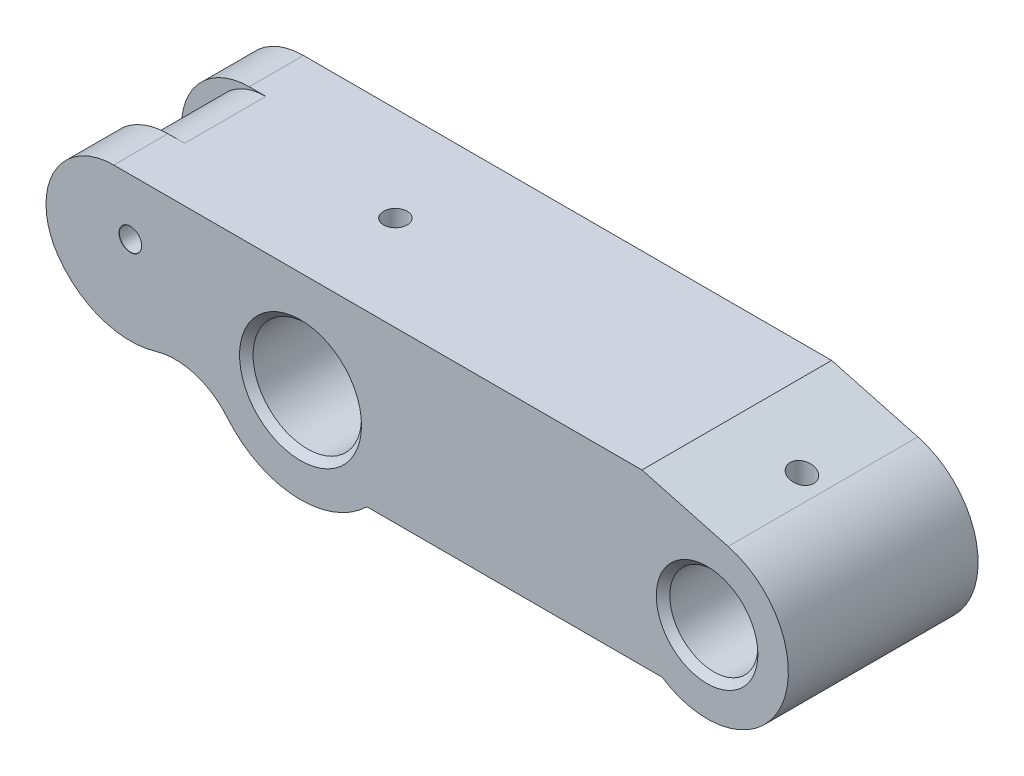
ISO-10303-21;
HEADER;
FILE_DESCRIPTION(('STEP AP214'),'2;1');
FILE_NAME('part.step','',(''),(''),'','','');
FILE_SCHEMA(('AUTOMOTIVE_DESIGN { 1 0 10303 214 1 1 1 1 }'));
ENDSEC;
DATA;
#1=APPLICATION_CONTEXT('core data for automotive mechanical design processes');
#2=APPLICATION_PROTOCOL_DEFINITION('international standard','automotive_design',2000,#1);
#3=PRODUCT_CONTEXT('',#1,'mechanical');
#4=PRODUCT('Part','Part','',(#3));
#5=PRODUCT_RELATED_PRODUCT_CATEGORY('part','',(#4));
#6=PRODUCT_DEFINITION_FORMATION('','',#4);
#7=PRODUCT_DEFINITION_CONTEXT('part definition',#1,'design');
#8=PRODUCT_DEFINITION('design','',#6,#7);
#9=PRODUCT_DEFINITION_SHAPE('','',#8);
#10=(LENGTH_UNIT() NAMED_UNIT(*) SI_UNIT(.MILLI.,.METRE.));
#11=(NAMED_UNIT(*) PLANE_ANGLE_UNIT() SI_UNIT($,.RADIAN.));
#12=(NAMED_UNIT(*) SI_UNIT($,.STERADIAN.) SOLID_ANGLE_UNIT());
#13=UNCERTAINTY_MEASURE_WITH_UNIT(LENGTH_MEASURE(1.E-05),#10,'distance_accuracy_value','');
#14=(GEOMETRIC_REPRESENTATION_CONTEXT(3) GLOBAL_UNCERTAINTY_ASSIGNED_CONTEXT((#13)) GLOBAL_UNIT_ASSIGNED_CONTEXT((#10,
#11,#12)) REPRESENTATION_CONTEXT('',''));
#15=CARTESIAN_POINT('',(0.,0.,0.));
#16=DIRECTION('',(0.,0.,1.));
#17=DIRECTION('',(1.,0.,0.));
#18=AXIS2_PLACEMENT_3D('',#15,#16,#17);
#19=CARTESIAN_POINT('',(60.,0.,-14.));
#20=DIRECTION('',(0.,0.,1.));
#21=DIRECTION('',(1.,0.,0.));
#22=AXIS2_PLACEMENT_3D('',#19,#20,#21);
#23=CYLINDRICAL_SURFACE('',#22,6.5);
#24=CARTESIAN_POINT('',(60.,0.,13.));
#25=DIRECTION('',(0.,0.,1.));
#26=DIRECTION('',(1.,0.,0.));
#27=AXIS2_PLACEMENT_3D('',#24,#25,#26);
#28=CIRCLE('',#27,6.5);
#29=CARTESIAN_POINT('',(66.5,0.,13.));
#30=VERTEX_POINT('',#29);
#31=EDGE_CURVE('E233',#30,#30,#28,.T.);
#32=ORIENTED_EDGE('',*,*,#31,.T.);
#33=EDGE_LOOP('',(#32));
#34=FACE_BOUND('',#33,.T.);
#35=CARTESIAN_POINT('',(60.,0.,-13.));
#36=DIRECTION('',(0.,0.,1.));
#37=DIRECTION('',(1.,0.,0.));
#38=AXIS2_PLACEMENT_3D('',#35,#36,#37);
#39=CIRCLE('',#38,6.5);
#40=CARTESIAN_POINT('',(66.5,0.,-13.));
#41=VERTEX_POINT('',#40);
#42=EDGE_CURVE('E195',#41,#41,#39,.F.);
#43=ORIENTED_EDGE('',*,*,#42,.T.);
#44=EDGE_LOOP('',(#43));
#45=FACE_BOUND('',#44,.T.);
#46=CARTESIAN_POINT('',(60.,6.5,-1.75));
#47=CARTESIAN_POINT('',(60.0964383845188,6.49999858077069,-1.7499977828074));
#48=CARTESIAN_POINT('',(60.1929003880739,6.49783268460272,-1.74200155390307));
#49=CARTESIAN_POINT('',(60.3830433658038,6.48940292607352,-1.71028591961752));
#50=CARTESIAN_POINT('',(60.4767230178816,6.48313714712618,-1.68655916056338));
#51=CARTESIAN_POINT('',(60.6585293424079,6.46719883607986,-1.62421145858157));
#52=CARTESIAN_POINT('',(60.7466630780937,6.45753074507855,-1.58560992574726));
#53=CARTESIAN_POINT('',(60.9152057731972,6.43580830743469,-1.49468095689279));
#54=CARTESIAN_POINT('',(60.9956141778656,6.42375378961486,-1.44235253616187));
#55=CARTESIAN_POINT('',(61.1483209729333,6.3982407904353,-1.32415178517782));
#56=CARTESIAN_POINT('',(61.220411119045,6.38475794940813,-1.25801567224596));
#57=CARTESIAN_POINT('',(61.3526224911526,6.3580634824803,-1.11464065374084));
#58=CARTESIAN_POINT('',(61.4127421445567,6.34485189241872,-1.03740029166848));
#59=CARTESIAN_POINT('',(61.5203271274729,6.31994601039438,-0.872339868303292));
#60=CARTESIAN_POINT('',(61.5675518274617,6.3082824201253,-0.784357907986763));
#61=CARTESIAN_POINT('',(61.6464560679089,6.28815172848446,-0.601338036406505));
#62=CARTESIAN_POINT('',(61.6781385364103,6.2796840251003,-0.506301458068461));
#63=CARTESIAN_POINT('',(61.7243337064602,6.26715552446657,-0.314178852122309));
#64=CARTESIAN_POINT('',(61.7392244492267,6.2629978742277,-0.217190193947394));
#65=CARTESIAN_POINT('',(61.7525922243856,6.25927094241735,-0.0220091357352755));
#66=CARTESIAN_POINT('',(61.7510723879578,6.25970078554045,0.0761830310982101));
#67=CARTESIAN_POINT('',(61.7319620384951,6.26501364939757,0.268024328514741));
#68=CARTESIAN_POINT('',(61.714830111451,6.26976958910593,0.361723222110499));
#69=CARTESIAN_POINT('',(61.6657168471479,6.28299513741087,0.544865031216859));
#70=CARTESIAN_POINT('',(61.6337343026641,6.2914650479176,0.634307600073772));
#71=CARTESIAN_POINT('',(61.5554566636195,6.31127516962315,0.807587747807669));
#72=CARTESIAN_POINT('',(61.5090016916308,6.3226471731219,0.891349315337331));
#73=CARTESIAN_POINT('',(61.4032093828983,6.34696318619014,1.05004880429497));
#74=CARTESIAN_POINT('',(61.3438694661784,6.35990751035925,1.12498495395174));
#75=CARTESIAN_POINT('',(61.2116518260954,6.38643765734519,1.26652520523311));
#76=CARTESIAN_POINT('',(61.1383893230823,6.40003049347118,1.33276907032923));
#77=CARTESIAN_POINT('',(60.9816287226865,6.42594017101052,1.45210498169239));
#78=CARTESIAN_POINT('',(60.8981302065396,6.43825696018163,1.50519648961656));
#79=CARTESIAN_POINT('',(60.7227029023141,6.46030497893973,1.59688349066958));
#80=CARTESIAN_POINT('',(60.6307378934542,6.47002433273058,1.63541272459217));
#81=CARTESIAN_POINT('',(60.4413141801261,6.48569657964708,1.69635922946787));
#82=CARTESIAN_POINT('',(60.3438567053188,6.49165031220561,1.7187800914534));
#83=CARTESIAN_POINT('',(60.1492879675027,6.49899311627936,1.74630531054513));
#84=CARTESIAN_POINT('',(60.0522507391934,6.50051122307747,1.75189931886128));
#85=CARTESIAN_POINT('',(59.8586242668815,6.49918326317947,1.74696574510972));
#86=CARTESIAN_POINT('',(59.7620349766906,6.49633765694801,1.73643986403369));
#87=CARTESIAN_POINT('',(59.573801172243,6.48668544438585,1.69996656502169));
#88=CARTESIAN_POINT('',(59.4820996099891,6.47994927429831,1.67429320907594));
#89=CARTESIAN_POINT('',(59.3043145365378,6.46328097858548,1.60857282182974));
#90=CARTESIAN_POINT('',(59.2182316412844,6.45334850327194,1.56852421776583));
#91=CARTESIAN_POINT('',(59.052232197971,6.43108814161772,1.47428833376005));
#92=CARTESIAN_POINT('',(58.9724721591767,6.41871658060233,1.41983593416573));
#93=CARTESIAN_POINT('',(58.8230500875743,6.39300765310752,1.29867061113965));
#94=CARTESIAN_POINT('',(58.753390094338,6.37967009237027,1.23195521750797));
#95=CARTESIAN_POINT('',(58.6240751634552,6.35305606912347,1.08587114701199));
#96=CARTESIAN_POINT('',(58.5647659670637,6.33979241811592,1.00619350712984));
#97=CARTESIAN_POINT('',(58.4603513455051,6.31524898835376,0.837735178091463));
#98=CARTESIAN_POINT('',(58.4152453372948,6.3039691281726,0.748954862799982));
#99=CARTESIAN_POINT('',(58.3408564712067,6.28480064726651,0.565246373403216));
#100=CARTESIAN_POINT('',(58.3114827338072,6.27689260413138,0.470357135721138));
#101=CARTESIAN_POINT('',(58.269182331408,6.26536192393188,0.276736303375831));
#102=CARTESIAN_POINT('',(58.2562513639001,6.26173816583469,0.178005720832141));
#103=CARTESIAN_POINT('',(58.2474545264397,6.25928126935112,-0.0169519056141194));
#104=CARTESIAN_POINT('',(58.2510324261671,6.2602919755006,-0.113152255566914));
#105=CARTESIAN_POINT('',(58.273858758265,6.26662379645531,-0.303523541672148));
#106=CARTESIAN_POINT('',(58.2931067724926,6.27194479624422,-0.397694531907395));
#107=CARTESIAN_POINT('',(58.3464016206556,6.28620380749049,-0.58061865799919));
#108=CARTESIAN_POINT('',(58.3803284410029,6.29511244645101,-0.669409210950858));
#109=CARTESIAN_POINT('',(58.4619247453846,6.31554316959918,-0.840105632385476));
#110=CARTESIAN_POINT('',(58.5095964229881,6.32706567087568,-0.922010399255227));
#111=CARTESIAN_POINT('',(58.6190058756084,6.35185689602158,-1.07926000063728));
#112=CARTESIAN_POINT('',(58.681122189747,6.36516758553448,-1.15433487479488));
#113=CARTESIAN_POINT('',(58.816940580298,6.39180345359531,-1.29317612586821));
#114=CARTESIAN_POINT('',(58.8906454818129,6.40512863488741,-1.35693973720047));
#115=CARTESIAN_POINT('',(59.0494993137465,6.43064166563152,-1.47272473629476));
#116=CARTESIAN_POINT('',(59.1348637916753,6.44279815943238,-1.5244579047006));
#117=CARTESIAN_POINT('',(59.3134029161651,6.46425897327365,-1.61275802734169));
#118=CARTESIAN_POINT('',(59.4065726023693,6.4735650875332,-1.64933452733467));
#119=CARTESIAN_POINT('',(59.5828042983082,6.48710112720969,-1.70161906201364));
#120=CARTESIAN_POINT('',(59.6651205488894,6.49190262266324,-1.71971928739135));
#121=CARTESIAN_POINT('',(59.8316186600637,6.498352516354,-1.74391010625434));
#122=CARTESIAN_POINT('',(59.9158003277393,6.50000123911909,-1.75000193581521));
#123=CARTESIAN_POINT('',(60.,6.5,-1.75));
#124=B_SPLINE_CURVE_WITH_KNOTS('',3,(#46,#47,#48,#49,#50,#51,#52,#53,#54,#55,#56,#57,#58,#59,
#60,#61,#62,#63,#64,#65,#66,#67,#68,#69,#70,#71,#72,#73,#74,#75,#76,#77,#78,#79,#80,#81,#82,#83,
#84,#85,#86,#87,#88,#89,#90,#91,#92,#93,#94,#95,#96,#97,#98,#99,#100,#101,#102,#103,#104,#105,
#106,#107,#108,#109,#110,#111,#112,#113,#114,#115,#116,#117,#118,#119,#120,#121,#122,#123),
.UNSPECIFIED.,.T.,.F.,(4,2,2,2,2,2,2,2,2,2,2,2,2,2,2,2,2,2,2,2,2,2,2,2,2,2,2,2,2,2,2,2,2,2,2,2,
2,2,4),(0.,0.289006335573644,0.578147870533283,0.866913375415958,1.15569960082183,
1.45061243661619,1.7455639902778,2.04569252574375,2.34576449744911,2.63893678842027,
2.93205314237057,3.21682770404029,3.50162541943879,3.7896880895128,4.07780849218071,
4.37551645612282,4.67323660362118,4.97229553813187,5.27128778285868,5.56149104488235,
5.85166368639026,6.13674063704052,6.42184878682808,6.71262194530668,7.00345374008025,
7.30265769073015,7.60184935740545,7.89929353562963,8.19665986690054,8.48408165680868,
8.77149577737717,9.05660314326086,9.34175603520537,9.63544979343368,9.92921526058424,
10.229423951748,10.5294432813106,10.7817986486686,11.0341280386515),.UNSPECIFIED.);
#125=CARTESIAN_POINT('',(60.,6.5,-1.75));
#126=VERTEX_POINT('',#125);
#127=EDGE_CURVE('E205',#126,#126,#124,.T.);
#128=ORIENTED_EDGE('',*,*,#127,.F.);
#129=EDGE_LOOP('',(#128));
#130=FACE_BOUND('',#129,.T.);
#131=ADVANCED_FACE('F37',(#34,#45,#130),#23,.F.);
#132=CARTESIAN_POINT('',(0.,0.,-14.));
#133=DIRECTION('',(0.,0.,1.));
#134=DIRECTION('',(1.,0.,0.));
#135=AXIS2_PLACEMENT_3D('',#132,#133,#134);
#136=CYLINDRICAL_SURFACE('',#135,8.);
#137=CARTESIAN_POINT('',(0.,0.,-13.));
#138=DIRECTION('',(0.,0.,1.));
#139=DIRECTION('',(1.,0.,0.));
#140=AXIS2_PLACEMENT_3D('',#137,#138,#139);
#141=CIRCLE('',#140,8.);
#142=CARTESIAN_POINT('',(8.,0.,-13.));
#143=VERTEX_POINT('',#142);
#144=EDGE_CURVE('E11',#143,#143,#141,.F.);
#145=ORIENTED_EDGE('',*,*,#144,.T.);
#146=EDGE_LOOP('',(#145));
#147=FACE_BOUND('',#146,.T.);
#148=CARTESIAN_POINT('',(0.,0.,13.));
#149=DIRECTION('',(0.,0.,1.));
#150=DIRECTION('',(1.,0.,0.));
#151=AXIS2_PLACEMENT_3D('',#148,#149,#150);
#152=CIRCLE('',#151,8.);
#153=CARTESIAN_POINT('',(8.,0.,13.));
#154=VERTEX_POINT('',#153);
#155=EDGE_CURVE('E46',#154,#154,#152,.T.);
#156=ORIENTED_EDGE('',*,*,#155,.T.);
#157=EDGE_LOOP('',(#156));
#158=FACE_BOUND('',#157,.T.);
#159=CARTESIAN_POINT('',(0.,8.,-1.75));
#160=CARTESIAN_POINT('',(0.0970593350151599,7.99999820976199,-1.74999668573652));
#161=CARTESIAN_POINT('',(0.194158718935764,7.99821570498197,-1.74189801333876));
#162=CARTESIAN_POINT('',(0.385599393425195,7.99127711250709,-1.70975094723352));
#163=CARTESIAN_POINT('',(0.479938663088247,7.98611861450843,-1.68569115785522));
#164=CARTESIAN_POINT('',(0.663064722809455,7.973002390759,-1.62241151171509));
#165=CARTESIAN_POINT('',(0.751857201182268,7.96504759005983,-1.58320749224003));
#166=CARTESIAN_POINT('',(0.921601058551572,7.94719730036193,-1.49080250331855));
#167=CARTESIAN_POINT('',(1.00255264012586,7.93730186152161,-1.4376018956207));
#168=CARTESIAN_POINT('',(1.15561917902203,7.91647673705169,-1.31781028937509));
#169=CARTESIAN_POINT('',(1.22759027771492,7.90553422192293,-1.25103768659902));
#170=CARTESIAN_POINT('',(1.3594054745263,7.88393863133685,-1.10638738709634));
#171=CARTESIAN_POINT('',(1.41924849117725,7.87328558176462,-1.02850870108833));
#172=CARTESIAN_POINT('',(1.52574354875191,7.85334859305538,-0.862793234416184));
#173=CARTESIAN_POINT('',(1.57224243577139,7.84408109293136,-0.774855876820513));
#174=CARTESIAN_POINT('',(1.64974688983709,7.82814863989338,-0.592179157988641));
#175=CARTESIAN_POINT('',(1.68075430981412,7.82148337574742,-0.497440611792102));
#176=CARTESIAN_POINT('',(1.72592019766616,7.8116407126826,-0.305411304961213));
#177=CARTESIAN_POINT('',(1.74033336961636,7.80841064772011,-0.208183208714533));
#178=CARTESIAN_POINT('',(1.75269359259673,7.80564592573969,-0.0126394392104041));
#179=CARTESIAN_POINT('',(1.75064266801701,7.80611081439809,0.0856760988530383));
#180=CARTESIAN_POINT('',(1.73033788658275,7.81063579363394,0.278710335103449));
#181=CARTESIAN_POINT('',(1.71237992433051,7.81463022611758,0.373461930057892));
#182=CARTESIAN_POINT('',(1.66123961776057,7.82566041064141,0.558574112916662));
#183=CARTESIAN_POINT('',(1.62805641913031,7.83269633334324,0.648934454105961));
#184=CARTESIAN_POINT('',(1.54713590259168,7.84908142575243,0.823530934289775));
#185=CARTESIAN_POINT('',(1.49928481262593,7.85844856683516,0.907712586421171));
#186=CARTESIAN_POINT('',(1.39046682908872,7.87842963219284,1.06696091821976));
#187=CARTESIAN_POINT('',(1.32949814730235,7.88904372636514,1.14202635296209));
#188=CARTESIAN_POINT('',(1.19460937489082,7.91060446260824,1.28261496039221));
#189=CARTESIAN_POINT('',(1.12043767851035,7.92155333191846,1.34789662473363));
#190=CARTESIAN_POINT('',(0.962075236204359,7.94234089245359,1.46513376259774));
#191=CARTESIAN_POINT('',(0.87788430875842,7.95217956355851,1.51708899462897));
#192=CARTESIAN_POINT('',(0.701578448800819,7.96967012140719,1.60625815763234));
#193=CARTESIAN_POINT('',(0.609447011102093,7.97731730300529,1.64344043607346));
#194=CARTESIAN_POINT('',(0.420039431240134,7.98952827368579,1.70172886696758));
#195=CARTESIAN_POINT('',(0.32276403956642,7.99409251123073,1.72283735766183));
#196=CARTESIAN_POINT('',(0.127901429629175,7.99955949359536,1.74802773381646));
#197=CARTESIAN_POINT('',(0.0303587923624098,8.00053317276936,1.75243952268135));
#198=CARTESIAN_POINT('',(-0.164069740933707,7.99890811067611,1.74500545649902));
#199=CARTESIAN_POINT('',(-0.260955681068858,7.9963096117651,1.73316070438523));
#200=CARTESIAN_POINT('',(-0.450227474165147,7.98787693126455,1.69382333511614));
#201=CARTESIAN_POINT('',(-0.542651027433255,7.98207854907296,1.66650375819105));
#202=CARTESIAN_POINT('',(-0.721603760326953,7.96789511342711,1.59718431391311));
#203=CARTESIAN_POINT('',(-0.808132436960157,7.95950983957769,1.55518319569776));
#204=CARTESIAN_POINT('',(-0.97420328371358,7.94090779663354,1.45700558634168));
#205=CARTESIAN_POINT('',(-1.05362808603427,7.93066659115626,1.40063529646222));
#206=CARTESIAN_POINT('',(-1.20200932191072,7.90953858077059,1.27557468866277));
#207=CARTESIAN_POINT('',(-1.2709643934262,7.898651692119,1.20688277031462));
#208=CARTESIAN_POINT('',(-1.39775310506235,7.87721432670249,1.05761497669148));
#209=CARTESIAN_POINT('',(-1.45535830381534,7.86667375069786,0.976843376890895));
#210=CARTESIAN_POINT('',(-1.55618726114744,7.84735161891496,0.806578421307945));
#211=CARTESIAN_POINT('',(-1.5994116419906,7.83856998703299,0.717085443120003));
#212=CARTESIAN_POINT('',(-1.66996009440668,7.82384388791895,0.532397964671863));
#213=CARTESIAN_POINT('',(-1.69737356394447,7.81788350386444,0.43723894513755));
#214=CARTESIAN_POINT('',(-1.73578387332271,7.80944608384998,0.243517995359719));
#215=CARTESIAN_POINT('',(-1.74678333897331,7.80696849073849,0.144956611986848));
#216=CARTESIAN_POINT('',(-1.75194163710046,7.80581228747132,-0.0504679246802261));
#217=CARTESIAN_POINT('',(-1.74646267912392,7.80705196674948,-0.147321209617316));
#218=CARTESIAN_POINT('',(-1.7196294204196,7.81300583032519,-0.338688623096862));
#219=CARTESIAN_POINT('',(-1.69827530684468,7.81771997366214,-0.433202779201831));
#220=CARTESIAN_POINT('',(-1.64047291068329,7.83005176572579,-0.616921231638351));
#221=CARTESIAN_POINT('',(-1.60407735181834,7.83765926522136,-0.706142842572677));
#222=CARTESIAN_POINT('',(-1.51727048968564,7.85492457749753,-0.877267291554995));
#223=CARTESIAN_POINT('',(-1.46685772585982,7.86458260391317,-0.959169365749573));
#224=CARTESIAN_POINT('',(-1.35224615086081,7.88510483142732,-1.11511534841375));
#225=CARTESIAN_POINT('',(-1.28778921304302,7.89598947159459,-1.18896689450643));
#226=CARTESIAN_POINT('',(-1.14744205512987,7.91760116007137,-1.32492424692627));
#227=CARTESIAN_POINT('',(-1.07154919548322,7.92832817136922,-1.3870273340814));
#228=CARTESIAN_POINT('',(-0.909297791240161,7.948581041013,-1.49849633485223));
#229=CARTESIAN_POINT('',(-0.82281622163743,7.95808950687133,-1.54768651274941));
#230=CARTESIAN_POINT('',(-0.642622783374224,7.97465942662438,-1.63075470037653));
#231=CARTESIAN_POINT('',(-0.548917055005223,7.98172293121789,-1.66464554963414));
#232=CARTESIAN_POINT('',(-0.37926518196647,7.99134698819861,-1.71011403623908));
#233=CARTESIAN_POINT('',(-0.304236707923587,7.99457176616468,-1.72504272890552));
#234=CARTESIAN_POINT('',(-0.152813724405272,7.99889892979335,-1.74498679580468));
#235=CARTESIAN_POINT('',(-0.0764192756345343,8.00000140953667,-1.75000260947197));
#236=CARTESIAN_POINT('',(0.,8.,-1.75));
#237=B_SPLINE_CURVE_WITH_KNOTS('',3,(#159,#160,#161,#162,#163,#164,#165,#166,#167,#168,#169,
#170,#171,#172,#173,#174,#175,#176,#177,#178,#179,#180,#181,#182,#183,#184,#185,#186,#187,#188,
#189,#190,#191,#192,#193,#194,#195,#196,#197,#198,#199,#200,#201,#202,#203,#204,#205,#206,#207,
#208,#209,#210,#211,#212,#213,#214,#215,#216,#217,#218,#219,#220,#221,#222,#223,#224,#225,#226,
#227,#228,#229,#230,#231,#232,#233,#234,#235,#236),.UNSPECIFIED.,.T.,.F.,(4,2,2,2,2,2,2,2,2,2,2,
2,2,2,2,2,2,2,2,2,2,2,2,2,2,2,2,2,2,2,2,2,2,2,2,2,2,2,4),(0.,0.290898279236849,
0.582004473362016,0.872807059744418,1.16360213093151,1.45858009706578,1.7535843549802,
2.05185017097239,2.3500803029129,2.64366919108494,2.93722198074803,3.2254263046949,
3.51364680222945,3.80416202417276,4.0947168748217,4.39155618463579,4.6884008731661,
4.9858781948911,5.28331223455319,5.5748377527744,5.86634349327398,6.15465219015976,
6.44298545684156,6.73543477188155,7.02792210003658,7.32580107786389,7.6236671646654,
7.9198321172811,8.21594968619037,8.50560626091059,8.79525942091184,9.08390577736446,
9.37258222133171,9.66709530846838,9.96167647726522,10.2600801610668,10.5582329503546,
10.7872806901088,11.0163182760262),.UNSPECIFIED.);
#238=CARTESIAN_POINT('',(0.,8.,-1.75));
#239=VERTEX_POINT('',#238);
#240=EDGE_CURVE('E196',#239,#239,#237,.T.);
#241=ORIENTED_EDGE('',*,*,#240,.F.);
#242=EDGE_LOOP('',(#241));
#243=FACE_BOUND('',#242,.T.);
#244=ADVANCED_FACE('F212',(#147,#158,#243),#136,.F.);
#245=CARTESIAN_POINT('',(-27.5655074312404,5.,14.));
#246=DIRECTION('',(0.,0.,-1.));
#247=DIRECTION('',(-1.,0.,0.));
#248=AXIS2_PLACEMENT_3D('',#245,#246,#247);
#249=CYLINDRICAL_SURFACE('',#248,10.);
#250=CARTESIAN_POINT('',(-27.5655074312404,5.,6.));
#251=DIRECTION('',(0.,0.,-1.));
#252=DIRECTION('',(-1.,0.,0.));
#253=AXIS2_PLACEMENT_3D('',#250,#251,#252);
#254=CIRCLE('',#253,10.);
#255=CARTESIAN_POINT('',(-35.7369605903223,-0.764317242217897,6.));
#256=VERTEX_POINT('',#255);
#257=CARTESIAN_POINT('',(-27.5655074312404,15.,6.));
#258=VERTEX_POINT('',#257);
#259=EDGE_CURVE('E138',#256,#258,#254,.T.);
#260=ORIENTED_EDGE('',*,*,#259,.F.);
#261=DIRECTION('',(0.,0.,-1.));
#262=VECTOR('',#261,1.);
#263=CARTESIAN_POINT('',(-35.7369605903223,-0.764317242217896,14.));
#264=LINE('',#263,#262);
#265=CARTESIAN_POINT('',(-35.7369605903223,-0.764317242217896,14.));
#266=VERTEX_POINT('',#265);
#267=EDGE_CURVE('E134',#266,#256,#264,.T.);
#268=ORIENTED_EDGE('',*,*,#267,.F.);
#269=CARTESIAN_POINT('',(-27.5655074312404,5.,14.));
#270=DIRECTION('',(0.,0.,1.));
#271=DIRECTION('',(1.,0.,0.));
#272=AXIS2_PLACEMENT_3D('',#269,#270,#271);
#273=CIRCLE('',#272,10.);
#274=CARTESIAN_POINT('',(-27.5655074312404,15.,14.));
#275=VERTEX_POINT('',#274);
#276=EDGE_CURVE('E120',#275,#266,#273,.T.);
#277=ORIENTED_EDGE('',*,*,#276,.F.);
#278=DIRECTION('',(0.,0.,-1.));
#279=VECTOR('',#278,1.);
#280=CARTESIAN_POINT('',(-27.5655074312404,15.,14.));
#281=LINE('',#280,#279);
#282=EDGE_CURVE('E177',#275,#258,#281,.T.);
#283=ORIENTED_EDGE('',*,*,#282,.T.);
#284=EDGE_LOOP('',(#260,#268,#277,#283));
#285=FACE_BOUND('',#284,.T.);
#286=ADVANCED_FACE('F135',(#285),#249,.T.);
#287=CARTESIAN_POINT('',(-25.1140714835158,6.72929517266537,14.));
#288=DIRECTION('',(0.,0.,-1.));
#289=DIRECTION('',(-1.,0.,0.));
#290=AXIS2_PLACEMENT_3D('',#287,#288,#289);
#291=CYLINDRICAL_SURFACE('',#290,13.);
#292=CARTESIAN_POINT('',(-25.1140714835158,6.72929517266537,6.));
#293=DIRECTION('',(0.,0.,-1.));
#294=DIRECTION('',(-1.,0.,0.));
#295=AXIS2_PLACEMENT_3D('',#292,#293,#294);
#296=CIRCLE('',#295,13.);
#297=CARTESIAN_POINT('',(-21.3718264681811,-5.72042780598772,6.));
#298=VERTEX_POINT('',#297);
#299=EDGE_CURVE('E269',#298,#256,#296,.T.);
#300=ORIENTED_EDGE('',*,*,#299,.F.);
#301=DIRECTION('',(0.,0.,-1.));
#302=VECTOR('',#301,1.);
#303=CARTESIAN_POINT('',(-21.3718264681811,-5.72042780598772,14.));
#304=LINE('',#303,#302);
#305=CARTESIAN_POINT('',(-21.3718264681811,-5.72042780598772,14.));
#306=VERTEX_POINT('',#305);
#307=EDGE_CURVE('E146',#306,#298,#304,.T.);
#308=ORIENTED_EDGE('',*,*,#307,.F.);
#309=CARTESIAN_POINT('',(-25.1140714835158,6.72929517266537,14.));
#310=DIRECTION('',(0.,0.,1.));
#311=DIRECTION('',(1.,0.,0.));
#312=AXIS2_PLACEMENT_3D('',#309,#310,#311);
#313=CIRCLE('',#312,13.);
#314=EDGE_CURVE('E124',#266,#306,#313,.T.);
#315=ORIENTED_EDGE('',*,*,#314,.F.);
#316=ORIENTED_EDGE('',*,*,#267,.T.);
#317=EDGE_LOOP('',(#300,#308,#315,#316));
#318=FACE_BOUND('',#317,.T.);
#319=ADVANCED_FACE('F144',(#318),#291,.T.);
#320=CARTESIAN_POINT('',(-18.4931764563852,-15.297137789567,14.));
#321=DIRECTION('',(0.,0.,-1.));
#322=DIRECTION('',(-1.,0.,0.));
#323=AXIS2_PLACEMENT_3D('',#320,#321,#322);
#324=CYLINDRICAL_SURFACE('',#323,10.);
#325=CARTESIAN_POINT('',(-18.4931764563852,-15.297137789567,6.));
#326=DIRECTION('',(0.,0.,-1.));
#327=DIRECTION('',(-1.,0.,0.));
#328=AXIS2_PLACEMENT_3D('',#325,#326,#327);
#329=CIRCLE('',#328,10.);
#330=CARTESIAN_POINT('',(-10.7876862662247,-8.92333037724742,6.));
#331=VERTEX_POINT('',#330);
#332=EDGE_CURVE('E190',#331,#298,#329,.F.);
#333=ORIENTED_EDGE('',*,*,#332,.F.);
#334=DIRECTION('',(0.,0.,-1.));
#335=VECTOR('',#334,1.);
#336=CARTESIAN_POINT('',(-10.7876862662247,-8.92333037724742,14.));
#337=LINE('',#336,#335);
#338=CARTESIAN_POINT('',(-10.7876862662247,-8.92333037724742,14.));
#339=VERTEX_POINT('',#338);
#340=EDGE_CURVE('E172',#339,#331,#337,.T.);
#341=ORIENTED_EDGE('',*,*,#340,.F.);
#342=CARTESIAN_POINT('',(-18.4931764563852,-15.297137789567,14.));
#343=DIRECTION('',(0.,0.,-1.));
#344=DIRECTION('',(-1.,0.,0.));
#345=AXIS2_PLACEMENT_3D('',#342,#343,#344);
#346=CIRCLE('',#345,10.);
#347=EDGE_CURVE('E62',#306,#339,#346,.T.);
#348=ORIENTED_EDGE('',*,*,#347,.F.);
#349=ORIENTED_EDGE('',*,*,#307,.T.);
#350=EDGE_LOOP('',(#333,#341,#348,#349));
#351=FACE_BOUND('',#350,.T.);
#352=ADVANCED_FACE('F347',(#351),#324,.F.);
#353=CARTESIAN_POINT('',(0.,0.,14.));
#354=DIRECTION('',(0.,0.,-1.));
#355=DIRECTION('',(-1.,0.,0.));
#356=AXIS2_PLACEMENT_3D('',#353,#354,#355);
#357=CYLINDRICAL_SURFACE('',#356,14.);
#358=CARTESIAN_POINT('',(0.,0.,-14.));
#359=DIRECTION('',(0.,0.,1.));
#360=DIRECTION('',(1.,0.,0.));
#361=AXIS2_PLACEMENT_3D('',#358,#359,#360);
#362=CIRCLE('',#361,14.);
#363=CARTESIAN_POINT('',(-10.7876862662247,-8.92333037724742,-14.));
#364=VERTEX_POINT('',#363);
#365=CARTESIAN_POINT('',(9.79795897113271,-10.,-14.));
#366=VERTEX_POINT('',#365);
#367=EDGE_CURVE('E151',#364,#366,#362,.T.);
#368=ORIENTED_EDGE('',*,*,#367,.T.);
#369=DIRECTION('',(0.,0.,-1.));
#370=VECTOR('',#369,1.);
#371=CARTESIAN_POINT('',(9.79795897113271,-10.,14.));
#372=LINE('',#371,#370);
#373=CARTESIAN_POINT('',(9.79795897113271,-10.,14.));
#374=VERTEX_POINT('',#373);
#375=EDGE_CURVE('E188',#374,#366,#372,.T.);
#376=ORIENTED_EDGE('',*,*,#375,.F.);
#377=CARTESIAN_POINT('',(0.,0.,14.));
#378=DIRECTION('',(0.,0.,1.));
#379=DIRECTION('',(1.,0.,0.));
#380=AXIS2_PLACEMENT_3D('',#377,#378,#379);
#381=CIRCLE('',#380,14.);
#382=EDGE_CURVE('E171',#339,#374,#381,.T.);
#383=ORIENTED_EDGE('',*,*,#382,.F.);
#384=ORIENTED_EDGE('',*,*,#340,.T.);
#385=DIRECTION('',(0.,0.,1.));
#386=VECTOR('',#385,1.);
#387=CARTESIAN_POINT('',(-10.7876862662247,-8.92333037724742,-6.));
#388=LINE('',#387,#386);
#389=CARTESIAN_POINT('',(-10.7876862662247,-8.92333037724742,-6.));
#390=VERTEX_POINT('',#389);
#391=EDGE_CURVE('E267',#390,#331,#388,.T.);
#392=ORIENTED_EDGE('',*,*,#391,.F.);
#393=EDGE_CURVE('E96',#390,#364,#337,.T.);
#394=ORIENTED_EDGE('',*,*,#393,.T.);
#395=EDGE_LOOP('',(#368,#376,#383,#384,#392,#394));
#396=FACE_BOUND('',#395,.T.);
#397=ADVANCED_FACE('F339',(#396),#357,.T.);
#398=CARTESIAN_POINT('',(9.79795897113271,-10.,14.));
#399=DIRECTION('',(0.,1.,0.));
#400=DIRECTION('',(0.,0.,1.));
#401=AXIS2_PLACEMENT_3D('',#398,#399,#400);
#402=PLANE('',#401);
#403=DIRECTION('',(1.,0.,0.));
#404=VECTOR('',#403,1.);
#405=CARTESIAN_POINT('',(9.79795897113271,-10.,-14.));
#406=LINE('',#405,#404);
#407=CARTESIAN_POINT('',(53.3667504192892,-10.,-14.));
#408=VERTEX_POINT('',#407);
#409=EDGE_CURVE('E153',#366,#408,#406,.T.);
#410=ORIENTED_EDGE('',*,*,#409,.T.);
#411=DIRECTION('',(0.,0.,-1.));
#412=VECTOR('',#411,1.);
#413=CARTESIAN_POINT('',(53.3667504192892,-10.,14.));
#414=LINE('',#413,#412);
#415=CARTESIAN_POINT('',(53.3667504192892,-10.,14.));
#416=VERTEX_POINT('',#415);
#417=EDGE_CURVE('E185',#416,#408,#414,.T.);
#418=ORIENTED_EDGE('',*,*,#417,.F.);
#419=DIRECTION('',(1.,0.,0.));
#420=VECTOR('',#419,1.);
#421=CARTESIAN_POINT('',(9.79795897113271,-10.,14.));
#422=LINE('',#421,#420);
#423=EDGE_CURVE('E105',#374,#416,#422,.T.);
#424=ORIENTED_EDGE('',*,*,#423,.F.);
#425=ORIENTED_EDGE('',*,*,#375,.T.);
#426=EDGE_LOOP('',(#410,#418,#424,#425));
#427=FACE_BOUND('',#426,.T.);
#428=ADVANCED_FACE('F386',(#427),#402,.F.);
#429=CARTESIAN_POINT('',(60.,0.,14.));
#430=DIRECTION('',(0.,0.,-1.));
#431=DIRECTION('',(-1.,0.,0.));
#432=AXIS2_PLACEMENT_3D('',#429,#430,#431);
#433=CYLINDRICAL_SURFACE('',#432,12.);
#434=CARTESIAN_POINT('',(60.,0.,-14.));
#435=DIRECTION('',(0.,0.,1.));
#436=DIRECTION('',(1.,0.,0.));
#437=AXIS2_PLACEMENT_3D('',#434,#435,#436);
#438=CIRCLE('',#437,12.);
#439=CARTESIAN_POINT('',(63.1058285412303,11.5911099154688,-14.));
#440=VERTEX_POINT('',#439);
#441=EDGE_CURVE('E156',#408,#440,#438,.T.);
#442=ORIENTED_EDGE('',*,*,#441,.T.);
#443=DIRECTION('',(0.,0.,-1.));
#444=VECTOR('',#443,1.);
#445=CARTESIAN_POINT('',(63.1058285412303,11.5911099154688,14.));
#446=LINE('',#445,#444);
#447=CARTESIAN_POINT('',(63.1058285412303,11.5911099154688,14.));
#448=VERTEX_POINT('',#447);
#449=EDGE_CURVE('E182',#448,#440,#446,.T.);
#450=ORIENTED_EDGE('',*,*,#449,.F.);
#451=CARTESIAN_POINT('',(60.,0.,14.));
#452=DIRECTION('',(0.,0.,1.));
#453=DIRECTION('',(1.,0.,0.));
#454=AXIS2_PLACEMENT_3D('',#451,#452,#453);
#455=CIRCLE('',#454,12.);
#456=EDGE_CURVE('E291',#416,#448,#455,.T.);
#457=ORIENTED_EDGE('',*,*,#456,.F.);
#458=ORIENTED_EDGE('',*,*,#417,.T.);
#459=EDGE_LOOP('',(#442,#450,#457,#458));
#460=FACE_BOUND('',#459,.T.);
#461=ADVANCED_FACE('F382',(#460),#433,.T.);
#462=CARTESIAN_POINT('',(50.3836775483421,15.,14.));
#463=DIRECTION('',(-0.258819045102521,-0.965925826289068,0.));
#464=DIRECTION('',(0.965925826289068,-0.258819045102521,0.));
#465=AXIS2_PLACEMENT_3D('',#462,#463,#464);
#466=PLANE('',#465);
#467=CARTESIAN_POINT('',(60.,12.423314164921,0.));
#468=DIRECTION('',(-0.258819045102521,-0.965925826289068,0.));
#469=DIRECTION('',(0.965925826289068,-0.258819045102521,0.));
#470=AXIS2_PLACEMENT_3D('',#467,#468,#469);
#471=ELLIPSE('',#470,1.81173331571765,1.75);
#472=CARTESIAN_POINT('',(61.75,11.9544030781665,0.));
#473=VERTEX_POINT('',#472);
#474=EDGE_CURVE('E240',#473,#473,#471,.F.);
#475=ORIENTED_EDGE('',*,*,#474,.F.);
#476=EDGE_LOOP('',(#475));
#477=FACE_BOUND('',#476,.T.);
#478=DIRECTION('',(-0.965925826289068,0.258819045102521,0.));
#479=VECTOR('',#478,1.);
#480=CARTESIAN_POINT('',(50.3836775483421,15.,-14.));
#481=LINE('',#480,#479);
#482=CARTESIAN_POINT('',(50.3836775483421,15.,-14.));
#483=VERTEX_POINT('',#482);
#484=EDGE_CURVE('E158',#440,#483,#481,.T.);
#485=ORIENTED_EDGE('',*,*,#484,.T.);
#486=DIRECTION('',(0.,0.,-1.));
#487=VECTOR('',#486,1.);
#488=CARTESIAN_POINT('',(50.3836775483421,15.,14.));
#489=LINE('',#488,#487);
#490=CARTESIAN_POINT('',(50.3836775483421,15.,14.));
#491=VERTEX_POINT('',#490);
#492=EDGE_CURVE('E179',#491,#483,#489,.T.);
#493=ORIENTED_EDGE('',*,*,#492,.F.);
#494=DIRECTION('',(-0.965925826289068,0.258819045102521,0.));
#495=VECTOR('',#494,1.);
#496=CARTESIAN_POINT('',(50.3836775483421,15.,14.));
#497=LINE('',#496,#495);
#498=EDGE_CURVE('E293',#448,#491,#497,.T.);
#499=ORIENTED_EDGE('',*,*,#498,.F.);
#500=ORIENTED_EDGE('',*,*,#449,.T.);
#501=EDGE_LOOP('',(#485,#493,#499,#500));
#502=FACE_BOUND('',#501,.T.);
#503=ADVANCED_FACE('F299',(#477,#502),#466,.F.);
#504=CARTESIAN_POINT('',(-27.5655074312404,15.,14.));
#505=DIRECTION('',(0.,-1.,0.));
#506=DIRECTION('',(1.,0.,0.));
#507=AXIS2_PLACEMENT_3D('',#504,#505,#506);
#508=PLANE('',#507);
#509=CARTESIAN_POINT('',(0.,15.,0.));
#510=DIRECTION('',(0.,1.,0.));
#511=DIRECTION('',(0.,0.,1.));
#512=AXIS2_PLACEMENT_3D('',#509,#510,#511);
#513=CIRCLE('',#512,1.75);
#514=CARTESIAN_POINT('',(0.,15.,1.75));
#515=VERTEX_POINT('',#514);
#516=EDGE_CURVE('E204',#515,#515,#513,.T.);
#517=ORIENTED_EDGE('',*,*,#516,.F.);
#518=EDGE_LOOP('',(#517));
#519=FACE_BOUND('',#518,.T.);
#520=CARTESIAN_POINT('',(-27.5655074312404,15.,-6.));
#521=VERTEX_POINT('',#520);
#522=CARTESIAN_POINT('',(-27.5655074312404,15.,-14.));
#523=VERTEX_POINT('',#522);
#524=EDGE_CURVE('E141',#521,#523,#281,.T.);
#525=ORIENTED_EDGE('',*,*,#524,.F.);
#526=DIRECTION('',(1.,0.,0.));
#527=VECTOR('',#526,1.);
#528=CARTESIAN_POINT('',(-27.5655074312404,15.,-6.));
#529=LINE('',#528,#527);
#530=CARTESIAN_POINT('',(-25.1140714835158,15.,-6.));
#531=VERTEX_POINT('',#530);
#532=EDGE_CURVE('E154',#521,#531,#529,.T.);
#533=ORIENTED_EDGE('',*,*,#532,.T.);
#534=DIRECTION('',(0.,0.,1.));
#535=VECTOR('',#534,1.);
#536=CARTESIAN_POINT('',(-25.1140714835158,15.,-6.));
#537=LINE('',#536,#535);
#538=CARTESIAN_POINT('',(-25.1140714835158,15.,6.));
#539=VERTEX_POINT('',#538);
#540=EDGE_CURVE('E270',#531,#539,#537,.T.);
#541=ORIENTED_EDGE('',*,*,#540,.T.);
#542=DIRECTION('',(1.,0.,0.));
#543=VECTOR('',#542,1.);
#544=CARTESIAN_POINT('',(-27.5655074312404,15.,6.));
#545=LINE('',#544,#543);
#546=EDGE_CURVE('E278',#258,#539,#545,.T.);
#547=ORIENTED_EDGE('',*,*,#546,.F.);
#548=ORIENTED_EDGE('',*,*,#282,.F.);
#549=DIRECTION('',(-1.,0.,0.));
#550=VECTOR('',#549,1.);
#551=CARTESIAN_POINT('',(-27.5655074312404,15.,14.));
#552=LINE('',#551,#550);
#553=EDGE_CURVE('E127',#491,#275,#552,.T.);
#554=ORIENTED_EDGE('',*,*,#553,.F.);
#555=ORIENTED_EDGE('',*,*,#492,.T.);
#556=DIRECTION('',(-1.,0.,0.));
#557=VECTOR('',#556,1.);
#558=CARTESIAN_POINT('',(-27.5655074312404,15.,-14.));
#559=LINE('',#558,#557);
#560=EDGE_CURVE('E160',#483,#523,#559,.T.);
#561=ORIENTED_EDGE('',*,*,#560,.T.);
#562=EDGE_LOOP('',(#525,#533,#541,#547,#548,#554,#555,#561));
#563=FACE_BOUND('',#562,.T.);
#564=ADVANCED_FACE('F304',(#519,#563),#508,.F.);
#565=CARTESIAN_POINT('',(-35.7369605903223,-0.764317242217897,-6.));
#566=VERTEX_POINT('',#565);
#567=CARTESIAN_POINT('',(-35.7369605903223,-0.764317242217896,-14.));
#568=VERTEX_POINT('',#567);
#569=EDGE_CURVE('E142',#566,#568,#264,.T.);
#570=ORIENTED_EDGE('',*,*,#569,.F.);
#571=CARTESIAN_POINT('',(-27.5655074312404,5.,-6.));
#572=DIRECTION('',(0.,0.,-1.));
#573=DIRECTION('',(-1.,0.,0.));
#574=AXIS2_PLACEMENT_3D('',#571,#572,#573);
#575=CIRCLE('',#574,10.);
#576=EDGE_CURVE('E284',#566,#521,#575,.T.);
#577=ORIENTED_EDGE('',*,*,#576,.T.);
#578=ORIENTED_EDGE('',*,*,#524,.T.);
#579=CARTESIAN_POINT('',(-27.5655074312404,5.,-14.));
#580=DIRECTION('',(0.,0.,1.));
#581=DIRECTION('',(1.,0.,0.));
#582=AXIS2_PLACEMENT_3D('',#579,#580,#581);
#583=CIRCLE('',#582,10.);
#584=EDGE_CURVE('E163',#523,#568,#583,.T.);
#585=ORIENTED_EDGE('',*,*,#584,.T.);
#586=EDGE_LOOP('',(#570,#577,#578,#585));
#587=FACE_BOUND('',#586,.T.);
#588=ADVANCED_FACE('F323',(#587),#249,.T.);
#589=CARTESIAN_POINT('',(-21.3718264681811,-5.72042780598772,-6.));
#590=VERTEX_POINT('',#589);
#591=CARTESIAN_POINT('',(-21.3718264681811,-5.72042780598772,-14.));
#592=VERTEX_POINT('',#591);
#593=EDGE_CURVE('E175',#590,#592,#304,.T.);
#594=ORIENTED_EDGE('',*,*,#593,.F.);
#595=CARTESIAN_POINT('',(-25.1140714835158,6.72929517266537,-6.));
#596=DIRECTION('',(0.,0.,-1.));
#597=DIRECTION('',(-1.,0.,0.));
#598=AXIS2_PLACEMENT_3D('',#595,#596,#597);
#599=CIRCLE('',#598,13.);
#600=EDGE_CURVE('E281',#590,#566,#599,.T.);
#601=ORIENTED_EDGE('',*,*,#600,.T.);
#602=ORIENTED_EDGE('',*,*,#569,.T.);
#603=CARTESIAN_POINT('',(-25.1140714835158,6.72929517266537,-14.));
#604=DIRECTION('',(0.,0.,1.));
#605=DIRECTION('',(1.,0.,0.));
#606=AXIS2_PLACEMENT_3D('',#603,#604,#605);
#607=CIRCLE('',#606,13.);
#608=EDGE_CURVE('E166',#568,#592,#607,.T.);
#609=ORIENTED_EDGE('',*,*,#608,.T.);
#610=EDGE_LOOP('',(#594,#601,#602,#609));
#611=FACE_BOUND('',#610,.T.);
#612=ADVANCED_FACE('F332',(#611),#291,.T.);
#613=ORIENTED_EDGE('',*,*,#393,.F.);
#614=CARTESIAN_POINT('',(-18.4931764563852,-15.297137789567,-6.));
#615=DIRECTION('',(0.,0.,-1.));
#616=DIRECTION('',(-1.,0.,0.));
#617=AXIS2_PLACEMENT_3D('',#614,#615,#616);
#618=CIRCLE('',#617,10.);
#619=EDGE_CURVE('E192',#390,#590,#618,.F.);
#620=ORIENTED_EDGE('',*,*,#619,.T.);
#621=ORIENTED_EDGE('',*,*,#593,.T.);
#622=CARTESIAN_POINT('',(-18.4931764563852,-15.297137789567,-14.));
#623=DIRECTION('',(0.,0.,-1.));
#624=DIRECTION('',(-1.,0.,0.));
#625=AXIS2_PLACEMENT_3D('',#622,#623,#624);
#626=CIRCLE('',#625,10.);
#627=EDGE_CURVE('E169',#592,#364,#626,.T.);
#628=ORIENTED_EDGE('',*,*,#627,.T.);
#629=EDGE_LOOP('',(#613,#620,#621,#628));
#630=FACE_BOUND('',#629,.T.);
#631=ADVANCED_FACE('F337',(#630),#324,.F.);
#632=CARTESIAN_POINT('',(0.,0.,14.));
#633=DIRECTION('',(0.,0.,1.));
#634=DIRECTION('',(1.,0.,0.));
#635=AXIS2_PLACEMENT_3D('',#632,#633,#634);
#636=PLANE('',#635);
#637=CARTESIAN_POINT('',(60.,0.,14.));
#638=DIRECTION('',(0.,0.,1.));
#639=DIRECTION('',(1.,0.,0.));
#640=AXIS2_PLACEMENT_3D('',#637,#638,#639);
#641=CIRCLE('',#640,7.50000000000002);
#642=CARTESIAN_POINT('',(67.5,0.,14.));
#643=VERTEX_POINT('',#642);
#644=EDGE_CURVE('E423',#643,#643,#641,.F.);
#645=ORIENTED_EDGE('',*,*,#644,.T.);
#646=EDGE_LOOP('',(#645));
#647=FACE_BOUND('',#646,.T.);
#648=CARTESIAN_POINT('',(0.,0.,14.));
#649=DIRECTION('',(0.,0.,1.));
#650=DIRECTION('',(1.,0.,0.));
#651=AXIS2_PLACEMENT_3D('',#648,#649,#650);
#652=CIRCLE('',#651,9.00000000000002);
#653=CARTESIAN_POINT('',(9.00000000000002,0.,14.));
#654=VERTEX_POINT('',#653);
#655=EDGE_CURVE('E428',#654,#654,#652,.F.);
#656=ORIENTED_EDGE('',*,*,#655,.T.);
#657=EDGE_LOOP('',(#656));
#658=FACE_BOUND('',#657,.T.);
#659=CARTESIAN_POINT('',(-25.1140714835158,6.72929517266537,14.));
#660=DIRECTION('',(0.,0.,1.));
#661=DIRECTION('',(1.,0.,0.));
#662=AXIS2_PLACEMENT_3D('',#659,#660,#661);
#663=CIRCLE('',#662,1.675);
#664=CARTESIAN_POINT('',(-23.4390714835158,6.72929517266537,14.));
#665=VERTEX_POINT('',#664);
#666=EDGE_CURVE('E250',#665,#665,#663,.T.);
#667=ORIENTED_EDGE('',*,*,#666,.F.);
#668=EDGE_LOOP('',(#667));
#669=FACE_BOUND('',#668,.T.);
#670=ORIENTED_EDGE('',*,*,#382,.T.);
#671=ORIENTED_EDGE('',*,*,#423,.T.);
#672=ORIENTED_EDGE('',*,*,#456,.T.);
#673=ORIENTED_EDGE('',*,*,#498,.T.);
#674=ORIENTED_EDGE('',*,*,#553,.T.);
#675=ORIENTED_EDGE('',*,*,#276,.T.);
#676=ORIENTED_EDGE('',*,*,#314,.T.);
#677=ORIENTED_EDGE('',*,*,#347,.T.);
#678=EDGE_LOOP('',(#670,#671,#672,#673,#674,#675,#676,#677));
#679=FACE_BOUND('',#678,.T.);
#680=ADVANCED_FACE('F122',(#647,#658,#669,#679),#636,.T.);
#681=CARTESIAN_POINT('',(0.,0.,-14.));
#682=DIRECTION('',(0.,0.,1.));
#683=DIRECTION('',(1.,0.,0.));
#684=AXIS2_PLACEMENT_3D('',#681,#682,#683);
#685=PLANE('',#684);
#686=CARTESIAN_POINT('',(60.,0.,-14.));
#687=DIRECTION('',(0.,0.,1.));
#688=DIRECTION('',(1.,0.,0.));
#689=AXIS2_PLACEMENT_3D('',#686,#687,#688);
#690=CIRCLE('',#689,7.49999999999999);
#691=CARTESIAN_POINT('',(67.5,0.,-14.));
#692=VERTEX_POINT('',#691);
#693=EDGE_CURVE('E422',#692,#692,#690,.T.);
#694=ORIENTED_EDGE('',*,*,#693,.T.);
#695=EDGE_LOOP('',(#694));
#696=FACE_BOUND('',#695,.T.);
#697=CARTESIAN_POINT('',(0.,0.,-14.));
#698=DIRECTION('',(0.,0.,1.));
#699=DIRECTION('',(1.,0.,0.));
#700=AXIS2_PLACEMENT_3D('',#697,#698,#699);
#701=CIRCLE('',#700,9.00000000000001);
#702=CARTESIAN_POINT('',(9.00000000000001,0.,-14.));
#703=VERTEX_POINT('',#702);
#704=EDGE_CURVE('E420',#703,#703,#701,.T.);
#705=ORIENTED_EDGE('',*,*,#704,.T.);
#706=EDGE_LOOP('',(#705));
#707=FACE_BOUND('',#706,.T.);
#708=CARTESIAN_POINT('',(-25.1140714835158,6.72929517266537,-14.));
#709=DIRECTION('',(0.,0.,-1.));
#710=DIRECTION('',(-1.,0.,0.));
#711=AXIS2_PLACEMENT_3D('',#708,#709,#710);
#712=CIRCLE('',#711,1.675);
#713=CARTESIAN_POINT('',(-26.7890714835158,6.72929517266537,-14.));
#714=VERTEX_POINT('',#713);
#715=EDGE_CURVE('E447',#714,#714,#712,.T.);
#716=ORIENTED_EDGE('',*,*,#715,.F.);
#717=EDGE_LOOP('',(#716));
#718=FACE_BOUND('',#717,.T.);
#719=ORIENTED_EDGE('',*,*,#367,.F.);
#720=ORIENTED_EDGE('',*,*,#627,.F.);
#721=ORIENTED_EDGE('',*,*,#608,.F.);
#722=ORIENTED_EDGE('',*,*,#584,.F.);
#723=ORIENTED_EDGE('',*,*,#560,.F.);
#724=ORIENTED_EDGE('',*,*,#484,.F.);
#725=ORIENTED_EDGE('',*,*,#441,.F.);
#726=ORIENTED_EDGE('',*,*,#409,.F.);
#727=EDGE_LOOP('',(#719,#720,#721,#722,#723,#724,#725,#726));
#728=FACE_BOUND('',#727,.T.);
#729=ADVANCED_FACE('F328',(#696,#707,#718,#728),#685,.F.);
#730=CARTESIAN_POINT('',(-20.5762297285784,-10.9689151067594,-6.));
#731=DIRECTION('',(0.,0.,-1.));
#732=DIRECTION('',(-1.,0.,0.));
#733=AXIS2_PLACEMENT_3D('',#730,#731,#732);
#734=PLANE('',#733);
#735=ORIENTED_EDGE('',*,*,#576,.F.);
#736=ORIENTED_EDGE('',*,*,#600,.F.);
#737=ORIENTED_EDGE('',*,*,#619,.F.);
#738=CARTESIAN_POINT('',(-20.5762297285784,-10.9689151067594,-6.));
#739=DIRECTION('',(0.,0.,1.));
#740=DIRECTION('',(-1.,0.,0.));
#741=AXIS2_PLACEMENT_3D('',#738,#739,#740);
#742=CIRCLE('',#741,10.);
#743=CARTESIAN_POINT('',(-23.0599006092707,-1.28225526157014,-6.));
#744=VERTEX_POINT('',#743);
#745=EDGE_CURVE('E256',#390,#744,#742,.T.);
#746=ORIENTED_EDGE('',*,*,#745,.T.);
#747=CARTESIAN_POINT('',(-25.1140714835158,6.72929517266537,-6.));
#748=DIRECTION('',(0.,0.,-1.));
#749=DIRECTION('',(1.,0.,0.));
#750=AXIS2_PLACEMENT_3D('',#747,#748,#749);
#751=CIRCLE('',#750,8.27070482733463);
#752=EDGE_CURVE('E259',#744,#531,#751,.T.);
#753=ORIENTED_EDGE('',*,*,#752,.T.);
#754=ORIENTED_EDGE('',*,*,#532,.F.);
#755=EDGE_LOOP('',(#735,#736,#737,#746,#753,#754));
#756=FACE_BOUND('',#755,.T.);
#757=ADVANCED_FACE('F318',(#756),#734,.F.);
#758=CARTESIAN_POINT('',(-20.5762297285784,-10.9689151067594,6.));
#759=DIRECTION('',(0.,0.,-1.));
#760=DIRECTION('',(-1.,0.,0.));
#761=AXIS2_PLACEMENT_3D('',#758,#759,#760);
#762=PLANE('',#761);
#763=ORIENTED_EDGE('',*,*,#546,.T.);
#764=CARTESIAN_POINT('',(-25.1140714835158,6.72929517266537,6.));
#765=DIRECTION('',(0.,0.,-1.));
#766=DIRECTION('',(1.,0.,0.));
#767=AXIS2_PLACEMENT_3D('',#764,#765,#766);
#768=CIRCLE('',#767,8.27070482733463);
#769=CARTESIAN_POINT('',(-23.0599006092707,-1.28225526157014,6.));
#770=VERTEX_POINT('',#769);
#771=EDGE_CURVE('E260',#770,#539,#768,.T.);
#772=ORIENTED_EDGE('',*,*,#771,.F.);
#773=CARTESIAN_POINT('',(-20.5762297285784,-10.9689151067594,6.));
#774=DIRECTION('',(0.,0.,1.));
#775=DIRECTION('',(-1.,0.,0.));
#776=AXIS2_PLACEMENT_3D('',#773,#774,#775);
#777=CIRCLE('',#776,10.);
#778=EDGE_CURVE('E53',#331,#770,#777,.T.);
#779=ORIENTED_EDGE('',*,*,#778,.F.);
#780=ORIENTED_EDGE('',*,*,#332,.T.);
#781=ORIENTED_EDGE('',*,*,#299,.T.);
#782=ORIENTED_EDGE('',*,*,#259,.T.);
#783=EDGE_LOOP('',(#763,#772,#779,#780,#781,#782));
#784=FACE_BOUND('',#783,.T.);
#785=ADVANCED_FACE('F348',(#784),#762,.T.);
#786=CARTESIAN_POINT('',(-20.5762297285784,-10.9689151067594,-6.));
#787=DIRECTION('',(0.,0.,1.));
#788=DIRECTION('',(1.,0.,0.));
#789=AXIS2_PLACEMENT_3D('',#786,#787,#788);
#790=CYLINDRICAL_SURFACE('',#789,10.);
#791=ORIENTED_EDGE('',*,*,#778,.T.);
#792=DIRECTION('',(0.,0.,1.));
#793=VECTOR('',#792,1.);
#794=CARTESIAN_POINT('',(-23.0599006092707,-1.28225526157014,-6.));
#795=LINE('',#794,#793);
#796=EDGE_CURVE('E263',#744,#770,#795,.T.);
#797=ORIENTED_EDGE('',*,*,#796,.F.);
#798=ORIENTED_EDGE('',*,*,#745,.F.);
#799=ORIENTED_EDGE('',*,*,#391,.T.);
#800=EDGE_LOOP('',(#791,#797,#798,#799));
#801=FACE_BOUND('',#800,.T.);
#802=ADVANCED_FACE('F343',(#801),#790,.F.);
#803=CARTESIAN_POINT('',(-25.1140714835158,6.72929517266537,-6.));
#804=DIRECTION('',(0.,0.,1.));
#805=DIRECTION('',(1.,0.,0.));
#806=AXIS2_PLACEMENT_3D('',#803,#804,#805);
#807=CYLINDRICAL_SURFACE('',#806,8.27070482733463);
#808=ORIENTED_EDGE('',*,*,#771,.T.);
#809=ORIENTED_EDGE('',*,*,#540,.F.);
#810=ORIENTED_EDGE('',*,*,#752,.F.);
#811=ORIENTED_EDGE('',*,*,#796,.T.);
#812=EDGE_LOOP('',(#808,#809,#810,#811));
#813=FACE_BOUND('',#812,.T.);
#814=ADVANCED_FACE('F219',(#813),#807,.T.);
#815=CARTESIAN_POINT('',(0.,15.,0.));
#816=DIRECTION('',(0.,-1.,0.));
#817=DIRECTION('',(0.,0.,-1.));
#818=AXIS2_PLACEMENT_3D('',#815,#816,#817);
#819=CYLINDRICAL_SURFACE('',#818,1.75);
#820=ORIENTED_EDGE('',*,*,#516,.T.);
#821=EDGE_LOOP('',(#820));
#822=FACE_BOUND('',#821,.T.);
#823=ORIENTED_EDGE('',*,*,#240,.T.);
#824=EDGE_LOOP('',(#823));
#825=FACE_BOUND('',#824,.T.);
#826=ADVANCED_FACE('F215',(#822,#825),#819,.F.);
#827=CARTESIAN_POINT('',(60.,15.,0.));
#828=DIRECTION('',(0.,-1.,0.));
#829=DIRECTION('',(0.,0.,-1.));
#830=AXIS2_PLACEMENT_3D('',#827,#828,#829);
#831=CYLINDRICAL_SURFACE('',#830,1.75);
#832=ORIENTED_EDGE('',*,*,#127,.T.);
#833=EDGE_LOOP('',(#832));
#834=FACE_BOUND('',#833,.T.);
#835=ORIENTED_EDGE('',*,*,#474,.T.);
#836=EDGE_LOOP('',(#835));
#837=FACE_BOUND('',#836,.T.);
#838=ADVANCED_FACE('F218',(#834,#837),#831,.F.);
#839=CARTESIAN_POINT('',(-25.1140714835158,6.72929517266537,6.));
#840=DIRECTION('',(0.,0.,1.));
#841=DIRECTION('',(1.,0.,0.));
#842=AXIS2_PLACEMENT_3D('',#839,#840,#841);
#843=CONICAL_SURFACE('',#842,1.65,1.02974425867665);
#844=CARTESIAN_POINT('',(-25.1140714835158,6.72929517266537,5.90987090714586));
#845=DIRECTION('',(0.,0.,1.));
#846=DIRECTION('',(1.,0.,0.));
#847=AXIS2_PLACEMENT_3D('',#844,#845,#846);
#848=CIRCLE('',#847,1.5);
#849=CARTESIAN_POINT('',(-23.6140714835158,6.72929517266537,5.90987090714586));
#850=VERTEX_POINT('',#849);
#851=EDGE_CURVE('E443',#850,#850,#848,.F.);
#852=ORIENTED_EDGE('',*,*,#851,.T.);
#853=EDGE_LOOP('',(#852));
#854=FACE_BOUND('',#853,.T.);
#855=CARTESIAN_POINT('',(-25.1140714835158,6.72929517266537,6.));
#856=DIRECTION('',(0.,0.,1.));
#857=DIRECTION('',(1.,0.,0.));
#858=AXIS2_PLACEMENT_3D('',#855,#856,#857);
#859=CIRCLE('',#858,1.65);
#860=CARTESIAN_POINT('',(-23.4640714835158,6.72929517266537,6.));
#861=VERTEX_POINT('',#860);
#862=EDGE_CURVE('E241',#861,#861,#859,.T.);
#863=ORIENTED_EDGE('',*,*,#862,.T.);
#864=EDGE_LOOP('',(#863));
#865=FACE_BOUND('',#864,.T.);
#866=ADVANCED_FACE('F475',(#854,#865),#843,.F.);
#867=CARTESIAN_POINT('',(-25.1140714835158,6.72929517266537,14.));
#868=DIRECTION('',(0.,0.,1.));
#869=DIRECTION('',(1.,0.,0.));
#870=AXIS2_PLACEMENT_3D('',#867,#868,#869);
#871=CYLINDRICAL_SURFACE('',#870,1.65);
#872=ORIENTED_EDGE('',*,*,#862,.F.);
#873=EDGE_LOOP('',(#872));
#874=FACE_BOUND('',#873,.T.);
#875=CARTESIAN_POINT('',(-25.1140714835158,6.72929517266537,13.975));
#876=DIRECTION('',(0.,0.,1.));
#877=DIRECTION('',(1.,0.,0.));
#878=AXIS2_PLACEMENT_3D('',#875,#876,#877);
#879=CIRCLE('',#878,1.65);
#880=CARTESIAN_POINT('',(-23.4640714835158,6.72929517266537,13.975));
#881=VERTEX_POINT('',#880);
#882=EDGE_CURVE('E245',#881,#881,#879,.T.);
#883=ORIENTED_EDGE('',*,*,#882,.T.);
#884=EDGE_LOOP('',(#883));
#885=FACE_BOUND('',#884,.T.);
#886=ADVANCED_FACE('F466',(#874,#885),#871,.F.);
#887=CARTESIAN_POINT('',(-25.1140714835158,6.72929517266537,14.));
#888=DIRECTION('',(0.,0.,1.));
#889=DIRECTION('',(1.,0.,0.));
#890=AXIS2_PLACEMENT_3D('',#887,#888,#889);
#891=CONICAL_SURFACE('',#890,1.675,0.785398163397448);
#892=ORIENTED_EDGE('',*,*,#882,.F.);
#893=EDGE_LOOP('',(#892));
#894=FACE_BOUND('',#893,.T.);
#895=ORIENTED_EDGE('',*,*,#666,.T.);
#896=EDGE_LOOP('',(#895));
#897=FACE_BOUND('',#896,.T.);
#898=ADVANCED_FACE('F462',(#894,#897),#891,.F.);
#899=CARTESIAN_POINT('',(-25.1140714835158,6.72929517266537,-6.));
#900=DIRECTION('',(0.,0.,-1.));
#901=DIRECTION('',(-1.,0.,0.));
#902=AXIS2_PLACEMENT_3D('',#899,#900,#901);
#903=CONICAL_SURFACE('',#902,1.65,1.02974425867665);
#904=CARTESIAN_POINT('',(-25.1140714835158,6.72929517266537,-5.90987090714586));
#905=DIRECTION('',(0.,0.,-1.));
#906=DIRECTION('',(-1.,0.,0.));
#907=AXIS2_PLACEMENT_3D('',#904,#905,#906);
#908=CIRCLE('',#907,1.5);
#909=CARTESIAN_POINT('',(-26.6140714835158,6.72929517266537,-5.90987090714586));
#910=VERTEX_POINT('',#909);
#911=EDGE_CURVE('E441',#910,#910,#908,.F.);
#912=ORIENTED_EDGE('',*,*,#911,.T.);
#913=EDGE_LOOP('',(#912));
#914=FACE_BOUND('',#913,.T.);
#915=CARTESIAN_POINT('',(-25.1140714835158,6.72929517266537,-6.));
#916=DIRECTION('',(0.,0.,-1.));
#917=DIRECTION('',(-1.,0.,0.));
#918=AXIS2_PLACEMENT_3D('',#915,#916,#917);
#919=CIRCLE('',#918,1.65);
#920=CARTESIAN_POINT('',(-26.7640714835158,6.72929517266537,-6.));
#921=VERTEX_POINT('',#920);
#922=EDGE_CURVE('E457',#921,#921,#919,.T.);
#923=ORIENTED_EDGE('',*,*,#922,.T.);
#924=EDGE_LOOP('',(#923));
#925=FACE_BOUND('',#924,.T.);
#926=ADVANCED_FACE('F465',(#914,#925),#903,.F.);
#927=CARTESIAN_POINT('',(-25.1140714835158,6.72929517266537,-14.));
#928=DIRECTION('',(0.,0.,-1.));
#929=DIRECTION('',(-1.,0.,0.));
#930=AXIS2_PLACEMENT_3D('',#927,#928,#929);
#931=CYLINDRICAL_SURFACE('',#930,1.65);
#932=ORIENTED_EDGE('',*,*,#922,.F.);
#933=EDGE_LOOP('',(#932));
#934=FACE_BOUND('',#933,.T.);
#935=CARTESIAN_POINT('',(-25.1140714835158,6.72929517266537,-13.975));
#936=DIRECTION('',(0.,0.,-1.));
#937=DIRECTION('',(-1.,0.,0.));
#938=AXIS2_PLACEMENT_3D('',#935,#936,#937);
#939=CIRCLE('',#938,1.65);
#940=CARTESIAN_POINT('',(-26.7640714835158,6.72929517266537,-13.975));
#941=VERTEX_POINT('',#940);
#942=EDGE_CURVE('E452',#941,#941,#939,.T.);
#943=ORIENTED_EDGE('',*,*,#942,.T.);
#944=EDGE_LOOP('',(#943));
#945=FACE_BOUND('',#944,.T.);
#946=ADVANCED_FACE('F473',(#934,#945),#931,.F.);
#947=CARTESIAN_POINT('',(-25.1140714835158,6.72929517266537,-14.));
#948=DIRECTION('',(0.,0.,-1.));
#949=DIRECTION('',(-1.,0.,0.));
#950=AXIS2_PLACEMENT_3D('',#947,#948,#949);
#951=CONICAL_SURFACE('',#950,1.675,0.785398163397448);
#952=ORIENTED_EDGE('',*,*,#942,.F.);
#953=EDGE_LOOP('',(#952));
#954=FACE_BOUND('',#953,.T.);
#955=ORIENTED_EDGE('',*,*,#715,.T.);
#956=EDGE_LOOP('',(#955));
#957=FACE_BOUND('',#956,.T.);
#958=ADVANCED_FACE('F568',(#954,#957),#951,.F.);
#959=CARTESIAN_POINT('',(-25.1140714835158,6.72929517266537,-14.));
#960=DIRECTION('',(0.,0.,1.));
#961=DIRECTION('',(1.,0.,0.));
#962=AXIS2_PLACEMENT_3D('',#959,#960,#961);
#963=CYLINDRICAL_SURFACE('',#962,1.5);
#964=ORIENTED_EDGE('',*,*,#911,.F.);
#965=EDGE_LOOP('',(#964));
#966=FACE_BOUND('',#965,.T.);
#967=ORIENTED_EDGE('',*,*,#851,.F.);
#968=EDGE_LOOP('',(#967));
#969=FACE_BOUND('',#968,.T.);
#970=ADVANCED_FACE('F400',(#966,#969),#963,.F.);
#971=CARTESIAN_POINT('',(60.,0.,13.));
#972=DIRECTION('',(0.,0.,1.));
#973=DIRECTION('',(1.,0.,0.));
#974=AXIS2_PLACEMENT_3D('',#971,#972,#973);
#975=CONICAL_SURFACE('',#974,6.5,0.785398163397457);
#976=ORIENTED_EDGE('',*,*,#644,.F.);
#977=EDGE_LOOP('',(#976));
#978=FACE_BOUND('',#977,.T.);
#979=ORIENTED_EDGE('',*,*,#31,.F.);
#980=EDGE_LOOP('',(#979));
#981=FACE_BOUND('',#980,.T.);
#982=ADVANCED_FACE('F393',(#978,#981),#975,.F.);
#983=CARTESIAN_POINT('',(60.,0.,-14.));
#984=DIRECTION('',(0.,0.,-1.));
#985=DIRECTION('',(-1.,0.,0.));
#986=AXIS2_PLACEMENT_3D('',#983,#984,#985);
#987=CONICAL_SURFACE('',#986,7.49999999999999,0.785398163397433);
#988=ORIENTED_EDGE('',*,*,#42,.F.);
#989=EDGE_LOOP('',(#988));
#990=FACE_BOUND('',#989,.T.);
#991=ORIENTED_EDGE('',*,*,#693,.F.);
#992=EDGE_LOOP('',(#991));
#993=FACE_BOUND('',#992,.T.);
#994=ADVANCED_FACE('F399',(#990,#993),#987,.F.);
#995=CARTESIAN_POINT('',(0.,0.,-14.));
#996=DIRECTION('',(0.,0.,-1.));
#997=DIRECTION('',(-1.,0.,0.));
#998=AXIS2_PLACEMENT_3D('',#995,#996,#997);
#999=CONICAL_SURFACE('',#998,9.00000000000001,0.785398163397441);
#1000=ORIENTED_EDGE('',*,*,#144,.F.);
#1001=EDGE_LOOP('',(#1000));
#1002=FACE_BOUND('',#1001,.T.);
#1003=ORIENTED_EDGE('',*,*,#704,.F.);
#1004=EDGE_LOOP('',(#1003));
#1005=FACE_BOUND('',#1004,.T.);
#1006=ADVANCED_FACE('F406',(#1002,#1005),#999,.F.);
#1007=CARTESIAN_POINT('',(0.,0.,13.));
#1008=DIRECTION('',(0.,0.,1.));
#1009=DIRECTION('',(1.,0.,0.));
#1010=AXIS2_PLACEMENT_3D('',#1007,#1008,#1009);
#1011=CONICAL_SURFACE('',#1010,8.,0.785398163397455);
#1012=ORIENTED_EDGE('',*,*,#655,.F.);
#1013=EDGE_LOOP('',(#1012));
#1014=FACE_BOUND('',#1013,.T.);
#1015=ORIENTED_EDGE('',*,*,#155,.F.);
#1016=EDGE_LOOP('',(#1015));
#1017=FACE_BOUND('',#1016,.T.);
#1018=ADVANCED_FACE('F40',(#1014,#1017),#1011,.F.);
#1019=CLOSED_SHELL('',(#131,#244,#286,#319,#352,#397,#428,#461,#503,#564,#588,#612,#631,#680,
#729,#757,#785,#802,#814,#826,#838,#866,#886,#898,#926,#946,#958,#970,#982,#994,#1006,#1018));
#1020=MANIFOLD_SOLID_BREP('B2',#1019);
#1021=ADVANCED_BREP_SHAPE_REPRESENTATION('',(#18,#1020),#14);
#1022=SHAPE_DEFINITION_REPRESENTATION(#9,#1021);
ENDSEC;
END-ISO-10303-21;
